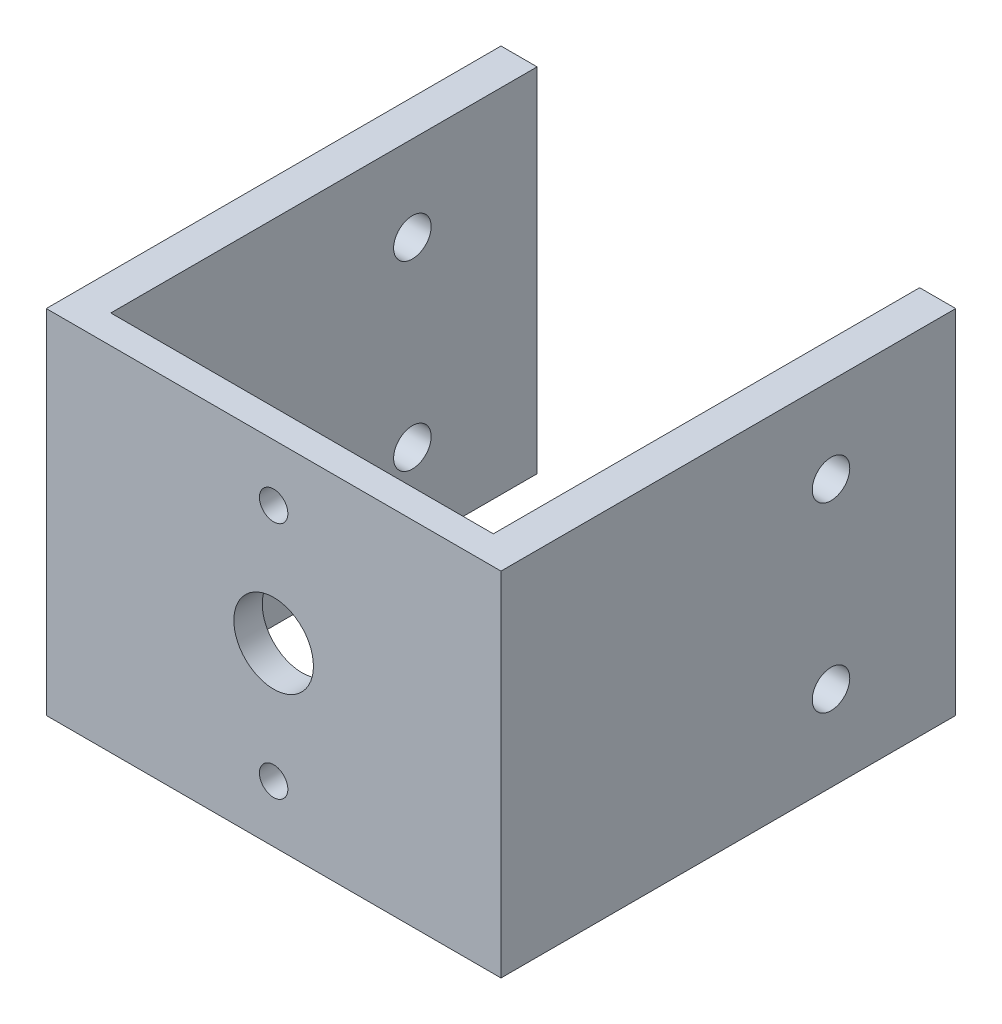
ISO-10303-21;
HEADER;
FILE_DESCRIPTION(('STEP AP214'),'2;1');
FILE_NAME('part.step','',(''),(''),'','','');
FILE_SCHEMA(('AUTOMOTIVE_DESIGN { 1 0 10303 214 1 1 1 1 }'));
ENDSEC;
DATA;
#1=APPLICATION_CONTEXT('core data for automotive mechanical design processes');
#2=APPLICATION_PROTOCOL_DEFINITION('international standard','automotive_design',2000,#1);
#3=PRODUCT_CONTEXT('',#1,'mechanical');
#4=PRODUCT('Part','Part','',(#3));
#5=PRODUCT_RELATED_PRODUCT_CATEGORY('part','',(#4));
#6=PRODUCT_DEFINITION_FORMATION('','',#4);
#7=PRODUCT_DEFINITION_CONTEXT('part definition',#1,'design');
#8=PRODUCT_DEFINITION('design','',#6,#7);
#9=PRODUCT_DEFINITION_SHAPE('','',#8);
#10=(LENGTH_UNIT() NAMED_UNIT(*) SI_UNIT(.MILLI.,.METRE.));
#11=(NAMED_UNIT(*) PLANE_ANGLE_UNIT() SI_UNIT($,.RADIAN.));
#12=(NAMED_UNIT(*) SI_UNIT($,.STERADIAN.) SOLID_ANGLE_UNIT());
#13=UNCERTAINTY_MEASURE_WITH_UNIT(LENGTH_MEASURE(1.E-05),#10,'distance_accuracy_value','');
#14=(GEOMETRIC_REPRESENTATION_CONTEXT(3) GLOBAL_UNCERTAINTY_ASSIGNED_CONTEXT((#13)) GLOBAL_UNIT_ASSIGNED_CONTEXT((#10,
#11,#12)) REPRESENTATION_CONTEXT('',''));
#15=CARTESIAN_POINT('',(0.,0.,0.));
#16=DIRECTION('',(0.,0.,1.));
#17=DIRECTION('',(1.,0.,0.));
#18=AXIS2_PLACEMENT_3D('',#15,#16,#17);
#19=CARTESIAN_POINT('',(0.,0.,-2.5));
#20=DIRECTION('',(0.,-1.,0.));
#21=DIRECTION('',(1.,0.,0.));
#22=AXIS2_PLACEMENT_3D('',#19,#20,#21);
#23=PLANE('',#22);
#24=DIRECTION('',(1.,0.,0.));
#25=VECTOR('',#24,1.);
#26=CARTESIAN_POINT('',(0.,0.,0.));
#27=LINE('',#26,#25);
#28=CARTESIAN_POINT('',(-20.,0.,0.));
#29=VERTEX_POINT('',#28);
#30=CARTESIAN_POINT('',(20.,0.,0.));
#31=VERTEX_POINT('',#30);
#32=EDGE_CURVE('E216',#29,#31,#27,.T.);
#33=ORIENTED_EDGE('',*,*,#32,.F.);
#34=DIRECTION('',(0.,0.,1.));
#35=VECTOR('',#34,1.);
#36=CARTESIAN_POINT('',(-20.,0.,-40.));
#37=LINE('',#36,#35);
#38=CARTESIAN_POINT('',(-20.,0.,-40.));
#39=VERTEX_POINT('',#38);
#40=EDGE_CURVE('E175',#39,#29,#37,.T.);
#41=ORIENTED_EDGE('',*,*,#40,.F.);
#42=DIRECTION('',(1.,0.,0.));
#43=VECTOR('',#42,1.);
#44=CARTESIAN_POINT('',(0.,0.,-40.));
#45=LINE('',#44,#43);
#46=CARTESIAN_POINT('',(-16.825,0.,-40.));
#47=VERTEX_POINT('',#46);
#48=EDGE_CURVE('E158',#39,#47,#45,.T.);
#49=ORIENTED_EDGE('',*,*,#48,.T.);
#50=DIRECTION('',(0.,0.,1.));
#51=VECTOR('',#50,1.);
#52=CARTESIAN_POINT('',(-16.825,0.,-40.));
#53=LINE('',#52,#51);
#54=CARTESIAN_POINT('',(-16.825,0.,-2.5));
#55=VERTEX_POINT('',#54);
#56=EDGE_CURVE('E171',#47,#55,#53,.T.);
#57=ORIENTED_EDGE('',*,*,#56,.T.);
#58=DIRECTION('',(1.,0.,0.));
#59=VECTOR('',#58,1.);
#60=CARTESIAN_POINT('',(0.,0.,-2.5));
#61=LINE('',#60,#59);
#62=CARTESIAN_POINT('',(16.825,0.,-2.5));
#63=VERTEX_POINT('',#62);
#64=EDGE_CURVE('E117',#55,#63,#61,.T.);
#65=ORIENTED_EDGE('',*,*,#64,.T.);
#66=DIRECTION('',(0.,0.,1.));
#67=VECTOR('',#66,1.);
#68=CARTESIAN_POINT('',(16.825,0.,-40.));
#69=LINE('',#68,#67);
#70=CARTESIAN_POINT('',(16.825,0.,-40.));
#71=VERTEX_POINT('',#70);
#72=EDGE_CURVE('E111',#71,#63,#69,.T.);
#73=ORIENTED_EDGE('',*,*,#72,.F.);
#74=DIRECTION('',(1.,0.,0.));
#75=VECTOR('',#74,1.);
#76=CARTESIAN_POINT('',(0.,0.,-40.));
#77=LINE('',#76,#75);
#78=CARTESIAN_POINT('',(20.,0.,-40.));
#79=VERTEX_POINT('',#78);
#80=EDGE_CURVE('E115',#71,#79,#77,.T.);
#81=ORIENTED_EDGE('',*,*,#80,.T.);
#82=DIRECTION('',(0.,0.,1.));
#83=VECTOR('',#82,1.);
#84=CARTESIAN_POINT('',(20.,0.,-40.));
#85=LINE('',#84,#83);
#86=EDGE_CURVE('E120',#79,#31,#85,.T.);
#87=ORIENTED_EDGE('',*,*,#86,.T.);
#88=EDGE_LOOP('',(#33,#41,#49,#57,#65,#73,#81,#87));
#89=FACE_BOUND('',#88,.T.);
#90=ADVANCED_FACE('F41',(#89),#23,.T.);
#91=CARTESIAN_POINT('',(0.,31.,-2.5));
#92=DIRECTION('',(0.,-1.,0.));
#93=DIRECTION('',(1.,0.,0.));
#94=AXIS2_PLACEMENT_3D('',#91,#92,#93);
#95=PLANE('',#94);
#96=DIRECTION('',(1.,0.,0.));
#97=VECTOR('',#96,1.);
#98=CARTESIAN_POINT('',(0.,31.,0.));
#99=LINE('',#98,#97);
#100=CARTESIAN_POINT('',(-20.,31.,0.));
#101=VERTEX_POINT('',#100);
#102=CARTESIAN_POINT('',(20.,31.,0.));
#103=VERTEX_POINT('',#102);
#104=EDGE_CURVE('E45',#101,#103,#99,.T.);
#105=ORIENTED_EDGE('',*,*,#104,.T.);
#106=DIRECTION('',(0.,0.,1.));
#107=VECTOR('',#106,1.);
#108=CARTESIAN_POINT('',(20.,31.,-40.));
#109=LINE('',#108,#107);
#110=CARTESIAN_POINT('',(20.,31.,-40.));
#111=VERTEX_POINT('',#110);
#112=EDGE_CURVE('E152',#111,#103,#109,.T.);
#113=ORIENTED_EDGE('',*,*,#112,.F.);
#114=DIRECTION('',(1.,0.,0.));
#115=VECTOR('',#114,1.);
#116=CARTESIAN_POINT('',(0.,31.,-40.));
#117=LINE('',#116,#115);
#118=CARTESIAN_POINT('',(16.825,31.,-40.));
#119=VERTEX_POINT('',#118);
#120=EDGE_CURVE('E121',#119,#111,#117,.T.);
#121=ORIENTED_EDGE('',*,*,#120,.F.);
#122=DIRECTION('',(0.,0.,1.));
#123=VECTOR('',#122,1.);
#124=CARTESIAN_POINT('',(16.825,31.,-40.));
#125=LINE('',#124,#123);
#126=CARTESIAN_POINT('',(16.825,31.,-2.5));
#127=VERTEX_POINT('',#126);
#128=EDGE_CURVE('E128',#119,#127,#125,.T.);
#129=ORIENTED_EDGE('',*,*,#128,.T.);
#130=DIRECTION('',(1.,0.,0.));
#131=VECTOR('',#130,1.);
#132=CARTESIAN_POINT('',(0.,31.,-2.5));
#133=LINE('',#132,#131);
#134=CARTESIAN_POINT('',(-16.825,31.,-2.5));
#135=VERTEX_POINT('',#134);
#136=EDGE_CURVE('E51',#135,#127,#133,.T.);
#137=ORIENTED_EDGE('',*,*,#136,.F.);
#138=DIRECTION('',(0.,0.,1.));
#139=VECTOR('',#138,1.);
#140=CARTESIAN_POINT('',(-16.825,31.,-40.));
#141=LINE('',#140,#139);
#142=CARTESIAN_POINT('',(-16.825,31.,-40.));
#143=VERTEX_POINT('',#142);
#144=EDGE_CURVE('E59',#143,#135,#141,.T.);
#145=ORIENTED_EDGE('',*,*,#144,.F.);
#146=DIRECTION('',(1.,0.,0.));
#147=VECTOR('',#146,1.);
#148=CARTESIAN_POINT('',(0.,31.,-40.));
#149=LINE('',#148,#147);
#150=CARTESIAN_POINT('',(-20.,31.,-40.));
#151=VERTEX_POINT('',#150);
#152=EDGE_CURVE('E165',#151,#143,#149,.T.);
#153=ORIENTED_EDGE('',*,*,#152,.F.);
#154=DIRECTION('',(0.,0.,1.));
#155=VECTOR('',#154,1.);
#156=CARTESIAN_POINT('',(-20.,31.,-40.));
#157=LINE('',#156,#155);
#158=EDGE_CURVE('E180',#151,#101,#157,.T.);
#159=ORIENTED_EDGE('',*,*,#158,.T.);
#160=EDGE_LOOP('',(#105,#113,#121,#129,#137,#145,#153,#159));
#161=FACE_BOUND('',#160,.T.);
#162=ADVANCED_FACE('F223',(#161),#95,.F.);
#163=CARTESIAN_POINT('',(0.,15.5,-2.5));
#164=DIRECTION('',(0.,0.,1.));
#165=DIRECTION('',(1.,0.,0.));
#166=AXIS2_PLACEMENT_3D('',#163,#164,#165);
#167=CYLINDRICAL_SURFACE('',#166,3.5);
#168=CARTESIAN_POINT('',(0.,15.5,-2.5));
#169=DIRECTION('',(0.,0.,1.));
#170=DIRECTION('',(1.,0.,0.));
#171=AXIS2_PLACEMENT_3D('',#168,#169,#170);
#172=CIRCLE('',#171,3.5);
#173=CARTESIAN_POINT('',(3.5,15.5,-2.5));
#174=VERTEX_POINT('',#173);
#175=EDGE_CURVE('E196',#174,#174,#172,.T.);
#176=ORIENTED_EDGE('',*,*,#175,.F.);
#177=EDGE_LOOP('',(#176));
#178=FACE_BOUND('',#177,.T.);
#179=CARTESIAN_POINT('',(0.,15.5,0.));
#180=DIRECTION('',(0.,0.,1.));
#181=DIRECTION('',(1.,0.,0.));
#182=AXIS2_PLACEMENT_3D('',#179,#180,#181);
#183=CIRCLE('',#182,3.5);
#184=CARTESIAN_POINT('',(3.5,15.5,0.));
#185=VERTEX_POINT('',#184);
#186=EDGE_CURVE('E213',#185,#185,#183,.T.);
#187=ORIENTED_EDGE('',*,*,#186,.T.);
#188=EDGE_LOOP('',(#187));
#189=FACE_BOUND('',#188,.T.);
#190=ADVANCED_FACE('F252',(#178,#189),#167,.F.);
#191=CARTESIAN_POINT('',(0.,26.,-2.5));
#192=DIRECTION('',(0.,0.,1.));
#193=DIRECTION('',(1.,0.,0.));
#194=AXIS2_PLACEMENT_3D('',#191,#192,#193);
#195=CYLINDRICAL_SURFACE('',#194,1.25);
#196=CARTESIAN_POINT('',(0.,26.,-2.5));
#197=DIRECTION('',(0.,0.,1.));
#198=DIRECTION('',(1.,0.,0.));
#199=AXIS2_PLACEMENT_3D('',#196,#197,#198);
#200=CIRCLE('',#199,1.25);
#201=CARTESIAN_POINT('',(1.25,26.,-2.5));
#202=VERTEX_POINT('',#201);
#203=EDGE_CURVE('E192',#202,#202,#200,.T.);
#204=ORIENTED_EDGE('',*,*,#203,.F.);
#205=EDGE_LOOP('',(#204));
#206=FACE_BOUND('',#205,.T.);
#207=CARTESIAN_POINT('',(0.,26.,0.));
#208=DIRECTION('',(0.,0.,1.));
#209=DIRECTION('',(1.,0.,0.));
#210=AXIS2_PLACEMENT_3D('',#207,#208,#209);
#211=CIRCLE('',#210,1.25);
#212=CARTESIAN_POINT('',(1.25,26.,0.));
#213=VERTEX_POINT('',#212);
#214=EDGE_CURVE('E209',#213,#213,#211,.T.);
#215=ORIENTED_EDGE('',*,*,#214,.T.);
#216=EDGE_LOOP('',(#215));
#217=FACE_BOUND('',#216,.T.);
#218=ADVANCED_FACE('F255',(#206,#217),#195,.F.);
#219=CARTESIAN_POINT('',(0.,5.,-2.5));
#220=DIRECTION('',(0.,0.,1.));
#221=DIRECTION('',(1.,0.,0.));
#222=AXIS2_PLACEMENT_3D('',#219,#220,#221);
#223=CYLINDRICAL_SURFACE('',#222,1.25);
#224=CARTESIAN_POINT('',(0.,5.,-2.5));
#225=DIRECTION('',(0.,0.,1.));
#226=DIRECTION('',(1.,0.,0.));
#227=AXIS2_PLACEMENT_3D('',#224,#225,#226);
#228=CIRCLE('',#227,1.25);
#229=CARTESIAN_POINT('',(1.25,5.,-2.5));
#230=VERTEX_POINT('',#229);
#231=EDGE_CURVE('E188',#230,#230,#228,.T.);
#232=ORIENTED_EDGE('',*,*,#231,.F.);
#233=EDGE_LOOP('',(#232));
#234=FACE_BOUND('',#233,.T.);
#235=CARTESIAN_POINT('',(0.,5.,0.));
#236=DIRECTION('',(0.,0.,1.));
#237=DIRECTION('',(1.,0.,0.));
#238=AXIS2_PLACEMENT_3D('',#235,#236,#237);
#239=CIRCLE('',#238,1.25);
#240=CARTESIAN_POINT('',(1.25,5.,0.));
#241=VERTEX_POINT('',#240);
#242=EDGE_CURVE('E179',#241,#241,#239,.T.);
#243=ORIENTED_EDGE('',*,*,#242,.T.);
#244=EDGE_LOOP('',(#243));
#245=FACE_BOUND('',#244,.T.);
#246=ADVANCED_FACE('F43',(#234,#245),#223,.F.);
#247=CARTESIAN_POINT('',(0.,0.,-2.5));
#248=DIRECTION('',(0.,0.,1.));
#249=DIRECTION('',(1.,0.,0.));
#250=AXIS2_PLACEMENT_3D('',#247,#248,#249);
#251=PLANE('',#250);
#252=ORIENTED_EDGE('',*,*,#231,.T.);
#253=EDGE_LOOP('',(#252));
#254=FACE_BOUND('',#253,.T.);
#255=ORIENTED_EDGE('',*,*,#203,.T.);
#256=EDGE_LOOP('',(#255));
#257=FACE_BOUND('',#256,.T.);
#258=ORIENTED_EDGE('',*,*,#175,.T.);
#259=EDGE_LOOP('',(#258));
#260=FACE_BOUND('',#259,.T.);
#261=ORIENTED_EDGE('',*,*,#64,.F.);
#262=DIRECTION('',(0.,1.,0.));
#263=VECTOR('',#262,1.);
#264=CARTESIAN_POINT('',(-16.825,0.,-2.5));
#265=LINE('',#264,#263);
#266=EDGE_CURVE('E11',#55,#135,#265,.T.);
#267=ORIENTED_EDGE('',*,*,#266,.T.);
#268=ORIENTED_EDGE('',*,*,#136,.T.);
#269=DIRECTION('',(0.,1.,0.));
#270=VECTOR('',#269,1.);
#271=CARTESIAN_POINT('',(16.825,0.,-2.5));
#272=LINE('',#271,#270);
#273=EDGE_CURVE('E67',#63,#127,#272,.T.);
#274=ORIENTED_EDGE('',*,*,#273,.F.);
#275=EDGE_LOOP('',(#261,#267,#268,#274));
#276=FACE_BOUND('',#275,.T.);
#277=ADVANCED_FACE('F232',(#254,#257,#260,#276),#251,.F.);
#278=CARTESIAN_POINT('',(0.,0.,0.));
#279=DIRECTION('',(0.,0.,1.));
#280=DIRECTION('',(1.,0.,0.));
#281=AXIS2_PLACEMENT_3D('',#278,#279,#280);
#282=PLANE('',#281);
#283=ORIENTED_EDGE('',*,*,#242,.F.);
#284=EDGE_LOOP('',(#283));
#285=FACE_BOUND('',#284,.T.);
#286=ORIENTED_EDGE('',*,*,#214,.F.);
#287=EDGE_LOOP('',(#286));
#288=FACE_BOUND('',#287,.T.);
#289=ORIENTED_EDGE('',*,*,#186,.F.);
#290=EDGE_LOOP('',(#289));
#291=FACE_BOUND('',#290,.T.);
#292=ORIENTED_EDGE('',*,*,#32,.T.);
#293=DIRECTION('',(0.,1.,0.));
#294=VECTOR('',#293,1.);
#295=CARTESIAN_POINT('',(20.,0.,0.));
#296=LINE('',#295,#294);
#297=EDGE_CURVE('E131',#31,#103,#296,.T.);
#298=ORIENTED_EDGE('',*,*,#297,.T.);
#299=ORIENTED_EDGE('',*,*,#104,.F.);
#300=DIRECTION('',(0.,1.,0.));
#301=VECTOR('',#300,1.);
#302=CARTESIAN_POINT('',(-20.,0.,0.));
#303=LINE('',#302,#301);
#304=EDGE_CURVE('E151',#29,#101,#303,.T.);
#305=ORIENTED_EDGE('',*,*,#304,.F.);
#306=EDGE_LOOP('',(#292,#298,#299,#305));
#307=FACE_BOUND('',#306,.T.);
#308=ADVANCED_FACE('F229',(#285,#288,#291,#307),#282,.T.);
#309=CARTESIAN_POINT('',(-16.825,0.,-40.));
#310=DIRECTION('',(1.,0.,0.));
#311=DIRECTION('',(0.,0.,-1.));
#312=AXIS2_PLACEMENT_3D('',#309,#310,#311);
#313=PLANE('',#312);
#314=CARTESIAN_POINT('',(-16.825,23.5,-29.03));
#315=DIRECTION('',(1.,0.,0.));
#316=DIRECTION('',(0.,0.,-1.));
#317=AXIS2_PLACEMENT_3D('',#314,#315,#316);
#318=CIRCLE('',#317,1.65);
#319=CARTESIAN_POINT('',(-16.825,23.5,-30.68));
#320=VERTEX_POINT('',#319);
#321=EDGE_CURVE('E148',#320,#320,#318,.T.);
#322=ORIENTED_EDGE('',*,*,#321,.F.);
#323=EDGE_LOOP('',(#322));
#324=FACE_BOUND('',#323,.T.);
#325=CARTESIAN_POINT('',(-16.825,7.5,-29.03));
#326=DIRECTION('',(1.,0.,0.));
#327=DIRECTION('',(0.,0.,-1.));
#328=AXIS2_PLACEMENT_3D('',#325,#326,#327);
#329=CIRCLE('',#328,1.65);
#330=CARTESIAN_POINT('',(-16.825,7.5,-30.68));
#331=VERTEX_POINT('',#330);
#332=EDGE_CURVE('E323',#331,#331,#329,.T.);
#333=ORIENTED_EDGE('',*,*,#332,.F.);
#334=EDGE_LOOP('',(#333));
#335=FACE_BOUND('',#334,.T.);
#336=ORIENTED_EDGE('',*,*,#266,.F.);
#337=ORIENTED_EDGE('',*,*,#56,.F.);
#338=DIRECTION('',(0.,1.,0.));
#339=VECTOR('',#338,1.);
#340=CARTESIAN_POINT('',(-16.825,0.,-40.));
#341=LINE('',#340,#339);
#342=EDGE_CURVE('E162',#47,#143,#341,.T.);
#343=ORIENTED_EDGE('',*,*,#342,.T.);
#344=ORIENTED_EDGE('',*,*,#144,.T.);
#345=EDGE_LOOP('',(#336,#337,#343,#344));
#346=FACE_BOUND('',#345,.T.);
#347=ADVANCED_FACE('F231',(#324,#335,#346),#313,.T.);
#348=CARTESIAN_POINT('',(-20.,0.,-40.));
#349=DIRECTION('',(1.,0.,0.));
#350=DIRECTION('',(0.,0.,-1.));
#351=AXIS2_PLACEMENT_3D('',#348,#349,#350);
#352=PLANE('',#351);
#353=CARTESIAN_POINT('',(-20.,23.5,-29.03));
#354=DIRECTION('',(-1.,0.,0.));
#355=DIRECTION('',(0.,0.,1.));
#356=AXIS2_PLACEMENT_3D('',#353,#354,#355);
#357=CIRCLE('',#356,1.65);
#358=CARTESIAN_POINT('',(-20.,23.5,-27.38));
#359=VERTEX_POINT('',#358);
#360=EDGE_CURVE('E338',#359,#359,#357,.T.);
#361=ORIENTED_EDGE('',*,*,#360,.F.);
#362=EDGE_LOOP('',(#361));
#363=FACE_BOUND('',#362,.T.);
#364=CARTESIAN_POINT('',(-20.,7.5,-29.03));
#365=DIRECTION('',(-1.,0.,0.));
#366=DIRECTION('',(0.,0.,1.));
#367=AXIS2_PLACEMENT_3D('',#364,#365,#366);
#368=CIRCLE('',#367,1.65);
#369=CARTESIAN_POINT('',(-20.,7.5,-27.38));
#370=VERTEX_POINT('',#369);
#371=EDGE_CURVE('E339',#370,#370,#368,.T.);
#372=ORIENTED_EDGE('',*,*,#371,.F.);
#373=EDGE_LOOP('',(#372));
#374=FACE_BOUND('',#373,.T.);
#375=ORIENTED_EDGE('',*,*,#304,.T.);
#376=ORIENTED_EDGE('',*,*,#158,.F.);
#377=DIRECTION('',(0.,1.,0.));
#378=VECTOR('',#377,1.);
#379=CARTESIAN_POINT('',(-20.,0.,-40.));
#380=LINE('',#379,#378);
#381=EDGE_CURVE('E168',#39,#151,#380,.T.);
#382=ORIENTED_EDGE('',*,*,#381,.F.);
#383=ORIENTED_EDGE('',*,*,#40,.T.);
#384=EDGE_LOOP('',(#375,#376,#382,#383));
#385=FACE_BOUND('',#384,.T.);
#386=ADVANCED_FACE('F239',(#363,#374,#385),#352,.F.);
#387=CARTESIAN_POINT('',(0.,0.,-40.));
#388=DIRECTION('',(0.,0.,1.));
#389=DIRECTION('',(1.,0.,0.));
#390=AXIS2_PLACEMENT_3D('',#387,#388,#389);
#391=PLANE('',#390);
#392=ORIENTED_EDGE('',*,*,#48,.F.);
#393=ORIENTED_EDGE('',*,*,#381,.T.);
#394=ORIENTED_EDGE('',*,*,#152,.T.);
#395=ORIENTED_EDGE('',*,*,#342,.F.);
#396=EDGE_LOOP('',(#392,#393,#394,#395));
#397=FACE_BOUND('',#396,.T.);
#398=ADVANCED_FACE('F276',(#397),#391,.F.);
#399=CARTESIAN_POINT('',(16.825,0.,-40.));
#400=DIRECTION('',(1.,0.,0.));
#401=DIRECTION('',(0.,0.,-1.));
#402=AXIS2_PLACEMENT_3D('',#399,#400,#401);
#403=PLANE('',#402);
#404=CARTESIAN_POINT('',(16.825,23.5,-29.03));
#405=DIRECTION('',(1.,0.,0.));
#406=DIRECTION('',(0.,0.,-1.));
#407=AXIS2_PLACEMENT_3D('',#404,#405,#406);
#408=CIRCLE('',#407,1.65);
#409=CARTESIAN_POINT('',(16.825,23.5,-30.68));
#410=VERTEX_POINT('',#409);
#411=EDGE_CURVE('E321',#410,#410,#408,.T.);
#412=ORIENTED_EDGE('',*,*,#411,.T.);
#413=EDGE_LOOP('',(#412));
#414=FACE_BOUND('',#413,.T.);
#415=CARTESIAN_POINT('',(16.825,7.5,-29.03));
#416=DIRECTION('',(1.,0.,0.));
#417=DIRECTION('',(0.,0.,-1.));
#418=AXIS2_PLACEMENT_3D('',#415,#416,#417);
#419=CIRCLE('',#418,1.65);
#420=CARTESIAN_POINT('',(16.825,7.5,-30.68));
#421=VERTEX_POINT('',#420);
#422=EDGE_CURVE('E328',#421,#421,#419,.T.);
#423=ORIENTED_EDGE('',*,*,#422,.T.);
#424=EDGE_LOOP('',(#423));
#425=FACE_BOUND('',#424,.T.);
#426=ORIENTED_EDGE('',*,*,#72,.T.);
#427=ORIENTED_EDGE('',*,*,#273,.T.);
#428=ORIENTED_EDGE('',*,*,#128,.F.);
#429=DIRECTION('',(0.,1.,0.));
#430=VECTOR('',#429,1.);
#431=CARTESIAN_POINT('',(16.825,0.,-40.));
#432=LINE('',#431,#430);
#433=EDGE_CURVE('E125',#71,#119,#432,.T.);
#434=ORIENTED_EDGE('',*,*,#433,.F.);
#435=EDGE_LOOP('',(#426,#427,#428,#434));
#436=FACE_BOUND('',#435,.T.);
#437=ADVANCED_FACE('F126',(#414,#425,#436),#403,.F.);
#438=CARTESIAN_POINT('',(20.,0.,-40.));
#439=DIRECTION('',(1.,0.,0.));
#440=DIRECTION('',(0.,1.,0.));
#441=AXIS2_PLACEMENT_3D('',#438,#439,#440);
#442=PLANE('',#441);
#443=CARTESIAN_POINT('',(20.,23.5,-29.03));
#444=DIRECTION('',(1.,0.,0.));
#445=DIRECTION('',(0.,1.,0.));
#446=AXIS2_PLACEMENT_3D('',#443,#444,#445);
#447=CIRCLE('',#446,1.65);
#448=CARTESIAN_POINT('',(20.,25.15,-29.03));
#449=VERTEX_POINT('',#448);
#450=EDGE_CURVE('E318',#449,#449,#447,.F.);
#451=ORIENTED_EDGE('',*,*,#450,.T.);
#452=EDGE_LOOP('',(#451));
#453=FACE_BOUND('',#452,.T.);
#454=CARTESIAN_POINT('',(20.,7.5,-29.03));
#455=DIRECTION('',(1.,0.,0.));
#456=DIRECTION('',(0.,1.,0.));
#457=AXIS2_PLACEMENT_3D('',#454,#455,#456);
#458=CIRCLE('',#457,1.65);
#459=CARTESIAN_POINT('',(20.,9.15,-29.03));
#460=VERTEX_POINT('',#459);
#461=EDGE_CURVE('E334',#460,#460,#458,.F.);
#462=ORIENTED_EDGE('',*,*,#461,.T.);
#463=EDGE_LOOP('',(#462));
#464=FACE_BOUND('',#463,.T.);
#465=ORIENTED_EDGE('',*,*,#297,.F.);
#466=ORIENTED_EDGE('',*,*,#86,.F.);
#467=DIRECTION('',(0.,1.,0.));
#468=VECTOR('',#467,1.);
#469=CARTESIAN_POINT('',(20.,0.,-40.));
#470=LINE('',#469,#468);
#471=EDGE_CURVE('E136',#79,#111,#470,.T.);
#472=ORIENTED_EDGE('',*,*,#471,.T.);
#473=ORIENTED_EDGE('',*,*,#112,.T.);
#474=EDGE_LOOP('',(#465,#466,#472,#473));
#475=FACE_BOUND('',#474,.T.);
#476=ADVANCED_FACE('F228',(#453,#464,#475),#442,.T.);
#477=CARTESIAN_POINT('',(0.,0.,-40.));
#478=DIRECTION('',(0.,0.,1.));
#479=DIRECTION('',(1.,0.,0.));
#480=AXIS2_PLACEMENT_3D('',#477,#478,#479);
#481=PLANE('',#480);
#482=ORIENTED_EDGE('',*,*,#433,.T.);
#483=ORIENTED_EDGE('',*,*,#120,.T.);
#484=ORIENTED_EDGE('',*,*,#471,.F.);
#485=ORIENTED_EDGE('',*,*,#80,.F.);
#486=EDGE_LOOP('',(#482,#483,#484,#485));
#487=FACE_BOUND('',#486,.T.);
#488=ADVANCED_FACE('F134',(#487),#481,.F.);
#489=CARTESIAN_POINT('',(24.6669047558312,7.5,-29.03));
#490=DIRECTION('',(-1.,0.,0.));
#491=DIRECTION('',(0.,0.,1.));
#492=AXIS2_PLACEMENT_3D('',#489,#490,#491);
#493=CYLINDRICAL_SURFACE('',#492,1.65);
#494=ORIENTED_EDGE('',*,*,#461,.F.);
#495=EDGE_LOOP('',(#494));
#496=FACE_BOUND('',#495,.T.);
#497=ORIENTED_EDGE('',*,*,#422,.F.);
#498=EDGE_LOOP('',(#497));
#499=FACE_BOUND('',#498,.T.);
#500=ADVANCED_FACE('F296',(#496,#499),#493,.F.);
#501=CARTESIAN_POINT('',(24.6669047558312,23.5,-29.03));
#502=DIRECTION('',(-1.,0.,0.));
#503=DIRECTION('',(0.,0.,1.));
#504=AXIS2_PLACEMENT_3D('',#501,#502,#503);
#505=CYLINDRICAL_SURFACE('',#504,1.65);
#506=ORIENTED_EDGE('',*,*,#450,.F.);
#507=EDGE_LOOP('',(#506));
#508=FACE_BOUND('',#507,.T.);
#509=ORIENTED_EDGE('',*,*,#411,.F.);
#510=EDGE_LOOP('',(#509));
#511=FACE_BOUND('',#510,.T.);
#512=ADVANCED_FACE('F301',(#508,#511),#505,.F.);
#513=ORIENTED_EDGE('',*,*,#332,.T.);
#514=EDGE_LOOP('',(#513));
#515=FACE_BOUND('',#514,.T.);
#516=ORIENTED_EDGE('',*,*,#371,.T.);
#517=EDGE_LOOP('',(#516));
#518=FACE_BOUND('',#517,.T.);
#519=ADVANCED_FACE('F297',(#515,#518),#493,.F.);
#520=ORIENTED_EDGE('',*,*,#321,.T.);
#521=EDGE_LOOP('',(#520));
#522=FACE_BOUND('',#521,.T.);
#523=ORIENTED_EDGE('',*,*,#360,.T.);
#524=EDGE_LOOP('',(#523));
#525=FACE_BOUND('',#524,.T.);
#526=ADVANCED_FACE('F300',(#522,#525),#505,.F.);
#527=CLOSED_SHELL('',(#90,#162,#190,#218,#246,#277,#308,#347,#386,#398,#437,#476,#488,#500,#512,
#519,#526));
#528=MANIFOLD_SOLID_BREP('B2',#527);
#529=ADVANCED_BREP_SHAPE_REPRESENTATION('',(#18,#528),#14);
#530=SHAPE_DEFINITION_REPRESENTATION(#9,#529);
ENDSEC;
END-ISO-10303-21;
